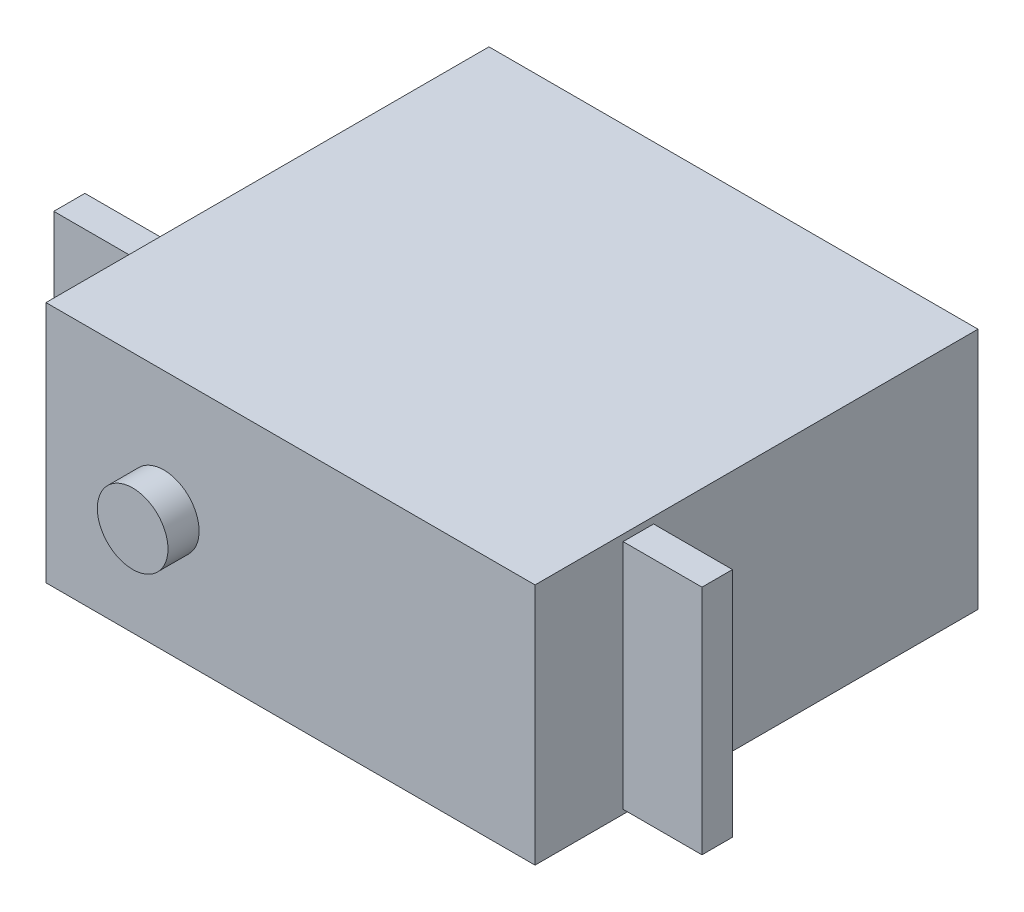
ISO-10303-21;
HEADER;
FILE_DESCRIPTION(('STEP AP214'),'2;1');
FILE_NAME('part.step','',(''),(''),'','','');
FILE_SCHEMA(('AUTOMOTIVE_DESIGN { 1 0 10303 214 1 1 1 1 }'));
ENDSEC;
DATA;
#1=APPLICATION_CONTEXT('core data for automotive mechanical design processes');
#2=APPLICATION_PROTOCOL_DEFINITION('international standard','automotive_design',2000,#1);
#3=PRODUCT_CONTEXT('',#1,'mechanical');
#4=PRODUCT('Part','Part','',(#3));
#5=PRODUCT_RELATED_PRODUCT_CATEGORY('part','',(#4));
#6=PRODUCT_DEFINITION_FORMATION('','',#4);
#7=PRODUCT_DEFINITION_CONTEXT('part definition',#1,'design');
#8=PRODUCT_DEFINITION('design','',#6,#7);
#9=PRODUCT_DEFINITION_SHAPE('','',#8);
#10=(LENGTH_UNIT() NAMED_UNIT(*) SI_UNIT(.MILLI.,.METRE.));
#11=(NAMED_UNIT(*) PLANE_ANGLE_UNIT() SI_UNIT($,.RADIAN.));
#12=(NAMED_UNIT(*) SI_UNIT($,.STERADIAN.) SOLID_ANGLE_UNIT());
#13=UNCERTAINTY_MEASURE_WITH_UNIT(LENGTH_MEASURE(1.E-05),#10,'distance_accuracy_value','');
#14=(GEOMETRIC_REPRESENTATION_CONTEXT(3) GLOBAL_UNCERTAINTY_ASSIGNED_CONTEXT((#13)) GLOBAL_UNIT_ASSIGNED_CONTEXT((#10,
#11,#12)) REPRESENTATION_CONTEXT('',''));
#15=CARTESIAN_POINT('',(0.,0.,0.));
#16=DIRECTION('',(0.,0.,1.));
#17=DIRECTION('',(1.,0.,0.));
#18=AXIS2_PLACEMENT_3D('',#15,#16,#17);
#19=CARTESIAN_POINT('',(-39.9161,19.812,36.1569));
#20=DIRECTION('',(0.,0.,-1.));
#21=DIRECTION('',(-1.,0.,0.));
#22=AXIS2_PLACEMENT_3D('',#19,#20,#21);
#23=PLANE('',#22);
#24=DIRECTION('',(1.,0.,0.));
#25=VECTOR('',#24,1.);
#26=CARTESIAN_POINT('',(-39.9161,0.,36.1569));
#27=LINE('',#26,#25);
#28=CARTESIAN_POINT('',(-39.9161,0.,36.1569));
#29=VERTEX_POINT('',#28);
#30=CARTESIAN_POINT('',(0.,0.,36.1569));
#31=VERTEX_POINT('',#30);
#32=EDGE_CURVE('E195',#29,#31,#27,.T.);
#33=ORIENTED_EDGE('',*,*,#32,.T.);
#34=DIRECTION('',(0.,-1.,0.));
#35=VECTOR('',#34,1.);
#36=CARTESIAN_POINT('',(0.,19.812,36.1569));
#37=LINE('',#36,#35);
#38=CARTESIAN_POINT('',(0.,19.812,36.1569));
#39=VERTEX_POINT('',#38);
#40=EDGE_CURVE('E205',#39,#31,#37,.T.);
#41=ORIENTED_EDGE('',*,*,#40,.F.);
#42=DIRECTION('',(1.,0.,0.));
#43=VECTOR('',#42,1.);
#44=CARTESIAN_POINT('',(-39.9161,19.812,36.1569));
#45=LINE('',#44,#43);
#46=CARTESIAN_POINT('',(-39.9161,19.812,36.1569));
#47=VERTEX_POINT('',#46);
#48=EDGE_CURVE('E185',#47,#39,#45,.T.);
#49=ORIENTED_EDGE('',*,*,#48,.F.);
#50=DIRECTION('',(0.,-1.,0.));
#51=VECTOR('',#50,1.);
#52=CARTESIAN_POINT('',(-39.9161,19.812,36.1569));
#53=LINE('',#52,#51);
#54=EDGE_CURVE('E41',#47,#29,#53,.T.);
#55=ORIENTED_EDGE('',*,*,#54,.T.);
#56=EDGE_LOOP('',(#33,#41,#49,#55));
#57=FACE_BOUND('',#56,.T.);
#58=CARTESIAN_POINT('',(-30.3022,9.906,36.1569));
#59=DIRECTION('',(0.,0.,-1.));
#60=DIRECTION('',(-1.,0.,0.));
#61=AXIS2_PLACEMENT_3D('',#58,#59,#60);
#62=CIRCLE('',#61,2.8829);
#63=CARTESIAN_POINT('',(-33.1851,9.906,36.1569));
#64=VERTEX_POINT('',#63);
#65=EDGE_CURVE('E11',#64,#64,#62,.F.);
#66=ORIENTED_EDGE('',*,*,#65,.F.);
#67=EDGE_LOOP('',(#66));
#68=FACE_BOUND('',#67,.T.);
#69=ADVANCED_FACE('F33',(#57,#68),#23,.F.);
#70=CARTESIAN_POINT('',(-39.9161,19.812,0.));
#71=DIRECTION('',(1.,0.,0.));
#72=DIRECTION('',(0.,0.,-1.));
#73=AXIS2_PLACEMENT_3D('',#70,#71,#72);
#74=PLANE('',#73);
#75=DIRECTION('',(0.,0.,1.));
#76=VECTOR('',#75,1.);
#77=CARTESIAN_POINT('',(-39.9161,0.,0.));
#78=LINE('',#77,#76);
#79=CARTESIAN_POINT('',(-39.9161,0.,0.));
#80=VERTEX_POINT('',#79);
#81=EDGE_CURVE('E181',#80,#29,#78,.T.);
#82=ORIENTED_EDGE('',*,*,#81,.T.);
#83=ORIENTED_EDGE('',*,*,#54,.F.);
#84=DIRECTION('',(0.,0.,1.));
#85=VECTOR('',#84,1.);
#86=CARTESIAN_POINT('',(-39.9161,19.812,0.));
#87=LINE('',#86,#85);
#88=CARTESIAN_POINT('',(-39.9161,19.812,0.));
#89=VERTEX_POINT('',#88);
#90=EDGE_CURVE('E182',#89,#47,#87,.T.);
#91=ORIENTED_EDGE('',*,*,#90,.F.);
#92=DIRECTION('',(0.,-1.,0.));
#93=VECTOR('',#92,1.);
#94=CARTESIAN_POINT('',(-39.9161,19.812,0.));
#95=LINE('',#94,#93);
#96=EDGE_CURVE('E192',#89,#80,#95,.T.);
#97=ORIENTED_EDGE('',*,*,#96,.T.);
#98=EDGE_LOOP('',(#82,#83,#91,#97));
#99=FACE_BOUND('',#98,.T.);
#100=DIRECTION('',(0.,1.,0.));
#101=VECTOR('',#100,1.);
#102=CARTESIAN_POINT('',(-39.9161,19.5072,29.083));
#103=LINE('',#102,#101);
#104=CARTESIAN_POINT('',(-39.9161,0.5842,29.083));
#105=VERTEX_POINT('',#104);
#106=CARTESIAN_POINT('',(-39.9161,19.5072,29.083));
#107=VERTEX_POINT('',#106);
#108=EDGE_CURVE('E142',#105,#107,#103,.T.);
#109=ORIENTED_EDGE('',*,*,#108,.F.);
#110=DIRECTION('',(0.,0.,1.));
#111=VECTOR('',#110,1.);
#112=CARTESIAN_POINT('',(-39.9161,0.5842,29.083));
#113=LINE('',#112,#111);
#114=CARTESIAN_POINT('',(-39.9161,0.5842,26.543));
#115=VERTEX_POINT('',#114);
#116=EDGE_CURVE('E139',#115,#105,#113,.T.);
#117=ORIENTED_EDGE('',*,*,#116,.F.);
#118=DIRECTION('',(0.,-1.,0.));
#119=VECTOR('',#118,1.);
#120=CARTESIAN_POINT('',(-39.9161,19.5072,26.543));
#121=LINE('',#120,#119);
#122=CARTESIAN_POINT('',(-39.9161,19.5072,26.543));
#123=VERTEX_POINT('',#122);
#124=EDGE_CURVE('E53',#123,#115,#121,.T.);
#125=ORIENTED_EDGE('',*,*,#124,.F.);
#126=DIRECTION('',(0.,0.,-1.));
#127=VECTOR('',#126,1.);
#128=CARTESIAN_POINT('',(-39.9161,19.5072,29.083));
#129=LINE('',#128,#127);
#130=EDGE_CURVE('E48',#107,#123,#129,.T.);
#131=ORIENTED_EDGE('',*,*,#130,.F.);
#132=EDGE_LOOP('',(#109,#117,#125,#131));
#133=FACE_BOUND('',#132,.T.);
#134=ADVANCED_FACE('F35',(#99,#133),#74,.F.);
#135=CARTESIAN_POINT('',(0.,19.812,0.));
#136=DIRECTION('',(-1.,0.,0.));
#137=DIRECTION('',(0.,0.,1.));
#138=AXIS2_PLACEMENT_3D('',#135,#136,#137);
#139=PLANE('',#138);
#140=DIRECTION('',(0.,0.,-1.));
#141=VECTOR('',#140,1.);
#142=CARTESIAN_POINT('',(0.,0.,0.));
#143=LINE('',#142,#141);
#144=CARTESIAN_POINT('',(0.,0.,0.));
#145=VERTEX_POINT('',#144);
#146=EDGE_CURVE('E197',#31,#145,#143,.T.);
#147=ORIENTED_EDGE('',*,*,#146,.T.);
#148=DIRECTION('',(0.,-1.,0.));
#149=VECTOR('',#148,1.);
#150=CARTESIAN_POINT('',(0.,19.812,0.));
#151=LINE('',#150,#149);
#152=CARTESIAN_POINT('',(0.,19.812,0.));
#153=VERTEX_POINT('',#152);
#154=EDGE_CURVE('E202',#153,#145,#151,.T.);
#155=ORIENTED_EDGE('',*,*,#154,.F.);
#156=DIRECTION('',(0.,0.,-1.));
#157=VECTOR('',#156,1.);
#158=CARTESIAN_POINT('',(0.,19.812,0.));
#159=LINE('',#158,#157);
#160=EDGE_CURVE('E188',#39,#153,#159,.T.);
#161=ORIENTED_EDGE('',*,*,#160,.F.);
#162=ORIENTED_EDGE('',*,*,#40,.T.);
#163=EDGE_LOOP('',(#147,#155,#161,#162));
#164=FACE_BOUND('',#163,.T.);
#165=DIRECTION('',(0.,-1.,0.));
#166=VECTOR('',#165,1.);
#167=CARTESIAN_POINT('',(0.,0.3556,28.9687));
#168=LINE('',#167,#166);
#169=CARTESIAN_POINT('',(0.,19.2786,28.9687));
#170=VERTEX_POINT('',#169);
#171=CARTESIAN_POINT('',(0.,0.3556,28.9687));
#172=VERTEX_POINT('',#171);
#173=EDGE_CURVE('E143',#170,#172,#168,.T.);
#174=ORIENTED_EDGE('',*,*,#173,.F.);
#175=DIRECTION('',(0.,0.,1.));
#176=VECTOR('',#175,1.);
#177=CARTESIAN_POINT('',(0.,19.2786,28.9687));
#178=LINE('',#177,#176);
#179=CARTESIAN_POINT('',(0.,19.2786,26.4795));
#180=VERTEX_POINT('',#179);
#181=EDGE_CURVE('E156',#180,#170,#178,.T.);
#182=ORIENTED_EDGE('',*,*,#181,.F.);
#183=DIRECTION('',(0.,1.,0.));
#184=VECTOR('',#183,1.);
#185=CARTESIAN_POINT('',(0.,0.3556,26.4795));
#186=LINE('',#185,#184);
#187=CARTESIAN_POINT('',(0.,0.355600000000001,26.4795));
#188=VERTEX_POINT('',#187);
#189=EDGE_CURVE('E165',#188,#180,#186,.T.);
#190=ORIENTED_EDGE('',*,*,#189,.F.);
#191=DIRECTION('',(0.,0.,-1.));
#192=VECTOR('',#191,1.);
#193=CARTESIAN_POINT('',(0.,0.3556,28.9687));
#194=LINE('',#193,#192);
#195=EDGE_CURVE('E146',#172,#188,#194,.T.);
#196=ORIENTED_EDGE('',*,*,#195,.F.);
#197=EDGE_LOOP('',(#174,#182,#190,#196));
#198=FACE_BOUND('',#197,.T.);
#199=ADVANCED_FACE('F222',(#164,#198),#139,.F.);
#200=CARTESIAN_POINT('',(-39.9161,19.812,0.));
#201=DIRECTION('',(0.,0.,1.));
#202=DIRECTION('',(1.,0.,0.));
#203=AXIS2_PLACEMENT_3D('',#200,#201,#202);
#204=PLANE('',#203);
#205=DIRECTION('',(-1.,0.,0.));
#206=VECTOR('',#205,1.);
#207=CARTESIAN_POINT('',(-39.9161,0.,0.));
#208=LINE('',#207,#206);
#209=EDGE_CURVE('E186',#145,#80,#208,.T.);
#210=ORIENTED_EDGE('',*,*,#209,.T.);
#211=ORIENTED_EDGE('',*,*,#96,.F.);
#212=DIRECTION('',(-1.,0.,0.));
#213=VECTOR('',#212,1.);
#214=CARTESIAN_POINT('',(-39.9161,19.812,0.));
#215=LINE('',#214,#213);
#216=EDGE_CURVE('E190',#153,#89,#215,.T.);
#217=ORIENTED_EDGE('',*,*,#216,.F.);
#218=ORIENTED_EDGE('',*,*,#154,.T.);
#219=EDGE_LOOP('',(#210,#211,#217,#218));
#220=FACE_BOUND('',#219,.T.);
#221=ADVANCED_FACE('F227',(#220),#204,.F.);
#222=CARTESIAN_POINT('',(0.,19.812,0.));
#223=DIRECTION('',(0.,1.,0.));
#224=DIRECTION('',(0.,0.,1.));
#225=AXIS2_PLACEMENT_3D('',#222,#223,#224);
#226=PLANE('',#225);
#227=ORIENTED_EDGE('',*,*,#90,.T.);
#228=ORIENTED_EDGE('',*,*,#48,.T.);
#229=ORIENTED_EDGE('',*,*,#160,.T.);
#230=ORIENTED_EDGE('',*,*,#216,.T.);
#231=EDGE_LOOP('',(#227,#228,#229,#230));
#232=FACE_BOUND('',#231,.T.);
#233=ADVANCED_FACE('F229',(#232),#226,.T.);
#234=CARTESIAN_POINT('',(0.,0.,0.));
#235=DIRECTION('',(0.,1.,0.));
#236=DIRECTION('',(0.,0.,1.));
#237=AXIS2_PLACEMENT_3D('',#234,#235,#236);
#238=PLANE('',#237);
#239=ORIENTED_EDGE('',*,*,#81,.F.);
#240=ORIENTED_EDGE('',*,*,#209,.F.);
#241=ORIENTED_EDGE('',*,*,#146,.F.);
#242=ORIENTED_EDGE('',*,*,#32,.F.);
#243=EDGE_LOOP('',(#239,#240,#241,#242));
#244=FACE_BOUND('',#243,.T.);
#245=ADVANCED_FACE('F218',(#244),#238,.F.);
#246=CARTESIAN_POINT('',(6.43890000000001,0.3556,28.9687));
#247=DIRECTION('',(0.,0.,-1.));
#248=DIRECTION('',(-1.,0.,0.));
#249=AXIS2_PLACEMENT_3D('',#246,#247,#248);
#250=PLANE('',#249);
#251=ORIENTED_EDGE('',*,*,#173,.T.);
#252=DIRECTION('',(-1.,0.,0.));
#253=VECTOR('',#252,1.);
#254=CARTESIAN_POINT('',(6.43890000000001,0.3556,28.9687));
#255=LINE('',#254,#253);
#256=CARTESIAN_POINT('',(6.43890000000001,0.3556,28.9687));
#257=VERTEX_POINT('',#256);
#258=EDGE_CURVE('E178',#257,#172,#255,.T.);
#259=ORIENTED_EDGE('',*,*,#258,.F.);
#260=DIRECTION('',(0.,-1.,0.));
#261=VECTOR('',#260,1.);
#262=CARTESIAN_POINT('',(6.43890000000001,0.3556,28.9687));
#263=LINE('',#262,#261);
#264=CARTESIAN_POINT('',(6.43890000000001,19.2786,28.9687));
#265=VERTEX_POINT('',#264);
#266=EDGE_CURVE('E152',#265,#257,#263,.T.);
#267=ORIENTED_EDGE('',*,*,#266,.F.);
#268=DIRECTION('',(-1.,0.,0.));
#269=VECTOR('',#268,1.);
#270=CARTESIAN_POINT('',(6.43890000000001,19.2786,28.9687));
#271=LINE('',#270,#269);
#272=EDGE_CURVE('E161',#265,#170,#271,.T.);
#273=ORIENTED_EDGE('',*,*,#272,.T.);
#274=EDGE_LOOP('',(#251,#259,#267,#273));
#275=FACE_BOUND('',#274,.T.);
#276=ADVANCED_FACE('F236',(#275),#250,.F.);
#277=CARTESIAN_POINT('',(6.43890000000001,0.3556,28.9687));
#278=DIRECTION('',(0.,1.,0.));
#279=DIRECTION('',(0.,0.,1.));
#280=AXIS2_PLACEMENT_3D('',#277,#278,#279);
#281=PLANE('',#280);
#282=ORIENTED_EDGE('',*,*,#195,.T.);
#283=DIRECTION('',(-1.,0.,0.));
#284=VECTOR('',#283,1.);
#285=CARTESIAN_POINT('',(6.43890000000001,0.3556,26.4795));
#286=LINE('',#285,#284);
#287=CARTESIAN_POINT('',(6.43890000000001,0.3556,26.4795));
#288=VERTEX_POINT('',#287);
#289=EDGE_CURVE('E175',#288,#188,#286,.T.);
#290=ORIENTED_EDGE('',*,*,#289,.F.);
#291=DIRECTION('',(0.,0.,-1.));
#292=VECTOR('',#291,1.);
#293=CARTESIAN_POINT('',(6.43890000000001,0.3556,28.9687));
#294=LINE('',#293,#292);
#295=EDGE_CURVE('E155',#257,#288,#294,.T.);
#296=ORIENTED_EDGE('',*,*,#295,.F.);
#297=ORIENTED_EDGE('',*,*,#258,.T.);
#298=EDGE_LOOP('',(#282,#290,#296,#297));
#299=FACE_BOUND('',#298,.T.);
#300=ADVANCED_FACE('F272',(#299),#281,.F.);
#301=CARTESIAN_POINT('',(6.43890000000001,0.3556,26.4795));
#302=DIRECTION('',(0.,0.,1.));
#303=DIRECTION('',(1.,0.,0.));
#304=AXIS2_PLACEMENT_3D('',#301,#302,#303);
#305=PLANE('',#304);
#306=ORIENTED_EDGE('',*,*,#189,.T.);
#307=DIRECTION('',(-1.,0.,0.));
#308=VECTOR('',#307,1.);
#309=CARTESIAN_POINT('',(6.43890000000001,19.2786,26.4795));
#310=LINE('',#309,#308);
#311=CARTESIAN_POINT('',(6.43890000000001,19.2786,26.4795));
#312=VERTEX_POINT('',#311);
#313=EDGE_CURVE('E172',#312,#180,#310,.T.);
#314=ORIENTED_EDGE('',*,*,#313,.F.);
#315=DIRECTION('',(0.,1.,0.));
#316=VECTOR('',#315,1.);
#317=CARTESIAN_POINT('',(6.43890000000001,0.3556,26.4795));
#318=LINE('',#317,#316);
#319=EDGE_CURVE('E158',#288,#312,#318,.T.);
#320=ORIENTED_EDGE('',*,*,#319,.F.);
#321=ORIENTED_EDGE('',*,*,#289,.T.);
#322=EDGE_LOOP('',(#306,#314,#320,#321));
#323=FACE_BOUND('',#322,.T.);
#324=ADVANCED_FACE('F279',(#323),#305,.F.);
#325=CARTESIAN_POINT('',(6.43890000000001,19.2786,28.9687));
#326=DIRECTION('',(0.,-1.,0.));
#327=DIRECTION('',(0.,0.,-1.));
#328=AXIS2_PLACEMENT_3D('',#325,#326,#327);
#329=PLANE('',#328);
#330=ORIENTED_EDGE('',*,*,#181,.T.);
#331=ORIENTED_EDGE('',*,*,#272,.F.);
#332=DIRECTION('',(0.,0.,1.));
#333=VECTOR('',#332,1.);
#334=CARTESIAN_POINT('',(6.43890000000001,19.2786,28.9687));
#335=LINE('',#334,#333);
#336=EDGE_CURVE('E160',#312,#265,#335,.T.);
#337=ORIENTED_EDGE('',*,*,#336,.F.);
#338=ORIENTED_EDGE('',*,*,#313,.T.);
#339=EDGE_LOOP('',(#330,#331,#337,#338));
#340=FACE_BOUND('',#339,.T.);
#341=ADVANCED_FACE('F287',(#340),#329,.F.);
#342=CARTESIAN_POINT('',(6.4389,0.,0.));
#343=DIRECTION('',(-1.,0.,0.));
#344=DIRECTION('',(0.,0.,1.));
#345=AXIS2_PLACEMENT_3D('',#342,#343,#344);
#346=PLANE('',#345);
#347=ORIENTED_EDGE('',*,*,#266,.T.);
#348=ORIENTED_EDGE('',*,*,#295,.T.);
#349=ORIENTED_EDGE('',*,*,#319,.T.);
#350=ORIENTED_EDGE('',*,*,#336,.T.);
#351=EDGE_LOOP('',(#347,#348,#349,#350));
#352=FACE_BOUND('',#351,.T.);
#353=ADVANCED_FACE('F295',(#352),#346,.F.);
#354=CARTESIAN_POINT('',(-46.355,19.5072,29.083));
#355=DIRECTION('',(0.,0.,-1.));
#356=DIRECTION('',(0.,1.,0.));
#357=AXIS2_PLACEMENT_3D('',#354,#355,#356);
#358=PLANE('',#357);
#359=ORIENTED_EDGE('',*,*,#108,.T.);
#360=DIRECTION('',(1.,0.,0.));
#361=VECTOR('',#360,1.);
#362=CARTESIAN_POINT('',(-46.355,19.5072,29.083));
#363=LINE('',#362,#361);
#364=CARTESIAN_POINT('',(-46.355,19.5072,29.083));
#365=VERTEX_POINT('',#364);
#366=EDGE_CURVE('E123',#365,#107,#363,.T.);
#367=ORIENTED_EDGE('',*,*,#366,.F.);
#368=DIRECTION('',(0.,1.,0.));
#369=VECTOR('',#368,1.);
#370=CARTESIAN_POINT('',(-46.355,19.5072,29.083));
#371=LINE('',#370,#369);
#372=CARTESIAN_POINT('',(-46.355,0.5842,29.083));
#373=VERTEX_POINT('',#372);
#374=EDGE_CURVE('E130',#373,#365,#371,.T.);
#375=ORIENTED_EDGE('',*,*,#374,.F.);
#376=DIRECTION('',(1.,0.,0.));
#377=VECTOR('',#376,1.);
#378=CARTESIAN_POINT('',(-46.355,0.5842,29.083));
#379=LINE('',#378,#377);
#380=EDGE_CURVE('E397',#373,#105,#379,.T.);
#381=ORIENTED_EDGE('',*,*,#380,.T.);
#382=EDGE_LOOP('',(#359,#367,#375,#381));
#383=FACE_BOUND('',#382,.T.);
#384=ADVANCED_FACE('F141',(#383),#358,.F.);
#385=CARTESIAN_POINT('',(-46.355,19.5072,29.083));
#386=DIRECTION('',(0.,-1.,0.));
#387=DIRECTION('',(0.,0.,-1.));
#388=AXIS2_PLACEMENT_3D('',#385,#386,#387);
#389=PLANE('',#388);
#390=ORIENTED_EDGE('',*,*,#130,.T.);
#391=DIRECTION('',(1.,0.,0.));
#392=VECTOR('',#391,1.);
#393=CARTESIAN_POINT('',(-46.355,19.5072,26.543));
#394=LINE('',#393,#392);
#395=CARTESIAN_POINT('',(-46.355,19.5072,26.543));
#396=VERTEX_POINT('',#395);
#397=EDGE_CURVE('E126',#396,#123,#394,.T.);
#398=ORIENTED_EDGE('',*,*,#397,.F.);
#399=DIRECTION('',(0.,0.,-1.));
#400=VECTOR('',#399,1.);
#401=CARTESIAN_POINT('',(-46.355,19.5072,29.083));
#402=LINE('',#401,#400);
#403=EDGE_CURVE('E119',#365,#396,#402,.T.);
#404=ORIENTED_EDGE('',*,*,#403,.F.);
#405=ORIENTED_EDGE('',*,*,#366,.T.);
#406=EDGE_LOOP('',(#390,#398,#404,#405));
#407=FACE_BOUND('',#406,.T.);
#408=ADVANCED_FACE('F121',(#407),#389,.F.);
#409=CARTESIAN_POINT('',(-46.355,19.5072,26.543));
#410=DIRECTION('',(0.,0.,1.));
#411=DIRECTION('',(1.,0.,0.));
#412=AXIS2_PLACEMENT_3D('',#409,#410,#411);
#413=PLANE('',#412);
#414=ORIENTED_EDGE('',*,*,#124,.T.);
#415=DIRECTION('',(1.,0.,0.));
#416=VECTOR('',#415,1.);
#417=CARTESIAN_POINT('',(-46.355,0.5842,26.543));
#418=LINE('',#417,#416);
#419=CARTESIAN_POINT('',(-46.355,0.5842,26.543));
#420=VERTEX_POINT('',#419);
#421=EDGE_CURVE('E148',#420,#115,#418,.T.);
#422=ORIENTED_EDGE('',*,*,#421,.F.);
#423=DIRECTION('',(0.,-1.,0.));
#424=VECTOR('',#423,1.);
#425=CARTESIAN_POINT('',(-46.355,19.5072,26.543));
#426=LINE('',#425,#424);
#427=EDGE_CURVE('E129',#396,#420,#426,.T.);
#428=ORIENTED_EDGE('',*,*,#427,.F.);
#429=ORIENTED_EDGE('',*,*,#397,.T.);
#430=EDGE_LOOP('',(#414,#422,#428,#429));
#431=FACE_BOUND('',#430,.T.);
#432=ADVANCED_FACE('F316',(#431),#413,.F.);
#433=CARTESIAN_POINT('',(-46.355,0.5842,29.083));
#434=DIRECTION('',(0.,1.,0.));
#435=DIRECTION('',(0.,0.,1.));
#436=AXIS2_PLACEMENT_3D('',#433,#434,#435);
#437=PLANE('',#436);
#438=ORIENTED_EDGE('',*,*,#116,.T.);
#439=ORIENTED_EDGE('',*,*,#380,.F.);
#440=DIRECTION('',(0.,0.,1.));
#441=VECTOR('',#440,1.);
#442=CARTESIAN_POINT('',(-46.355,0.5842,29.083));
#443=LINE('',#442,#441);
#444=EDGE_CURVE('E135',#420,#373,#443,.T.);
#445=ORIENTED_EDGE('',*,*,#444,.F.);
#446=ORIENTED_EDGE('',*,*,#421,.T.);
#447=EDGE_LOOP('',(#438,#439,#445,#446));
#448=FACE_BOUND('',#447,.T.);
#449=ADVANCED_FACE('F323',(#448),#437,.F.);
#450=CARTESIAN_POINT('',(-46.355,0.,0.));
#451=DIRECTION('',(1.,0.,0.));
#452=DIRECTION('',(0.,0.,-1.));
#453=AXIS2_PLACEMENT_3D('',#450,#451,#452);
#454=PLANE('',#453);
#455=ORIENTED_EDGE('',*,*,#374,.T.);
#456=ORIENTED_EDGE('',*,*,#403,.T.);
#457=ORIENTED_EDGE('',*,*,#427,.T.);
#458=ORIENTED_EDGE('',*,*,#444,.T.);
#459=EDGE_LOOP('',(#455,#456,#457,#458));
#460=FACE_BOUND('',#459,.T.);
#461=ADVANCED_FACE('F133',(#460),#454,.F.);
#462=CARTESIAN_POINT('',(-30.3022,9.906,38.6969));
#463=DIRECTION('',(0.,0.,-1.));
#464=DIRECTION('',(-1.,0.,0.));
#465=AXIS2_PLACEMENT_3D('',#462,#463,#464);
#466=CYLINDRICAL_SURFACE('',#465,2.8829);
#467=CARTESIAN_POINT('',(-30.3022,9.906,38.6969));
#468=DIRECTION('',(0.,0.,1.));
#469=DIRECTION('',(1.,0.,0.));
#470=AXIS2_PLACEMENT_3D('',#467,#468,#469);
#471=CIRCLE('',#470,2.8829);
#472=CARTESIAN_POINT('',(-27.4193,9.906,38.6969));
#473=VERTEX_POINT('',#472);
#474=EDGE_CURVE('E392',#473,#473,#471,.T.);
#475=ORIENTED_EDGE('',*,*,#474,.F.);
#476=EDGE_LOOP('',(#475));
#477=FACE_BOUND('',#476,.T.);
#478=ORIENTED_EDGE('',*,*,#65,.T.);
#479=EDGE_LOOP('',(#478));
#480=FACE_BOUND('',#479,.T.);
#481=ADVANCED_FACE('F338',(#477,#480),#466,.T.);
#482=CARTESIAN_POINT('',(-30.3022,9.906,38.6969));
#483=DIRECTION('',(0.,0.,1.));
#484=DIRECTION('',(1.,0.,0.));
#485=AXIS2_PLACEMENT_3D('',#482,#483,#484);
#486=PLANE('',#485);
#487=ORIENTED_EDGE('',*,*,#474,.T.);
#488=EDGE_LOOP('',(#487));
#489=FACE_BOUND('',#488,.T.);
#490=ADVANCED_FACE('F345',(#489),#486,.T.);
#491=CLOSED_SHELL('',(#69,#134,#199,#221,#233,#245,#276,#300,#324,#341,#353,#384,#408,#432,#449,
#461,#481,#490));
#492=MANIFOLD_SOLID_BREP('B2',#491);
#493=ADVANCED_BREP_SHAPE_REPRESENTATION('',(#18,#492),#14);
#494=SHAPE_DEFINITION_REPRESENTATION(#9,#493);
ENDSEC;
END-ISO-10303-21;
